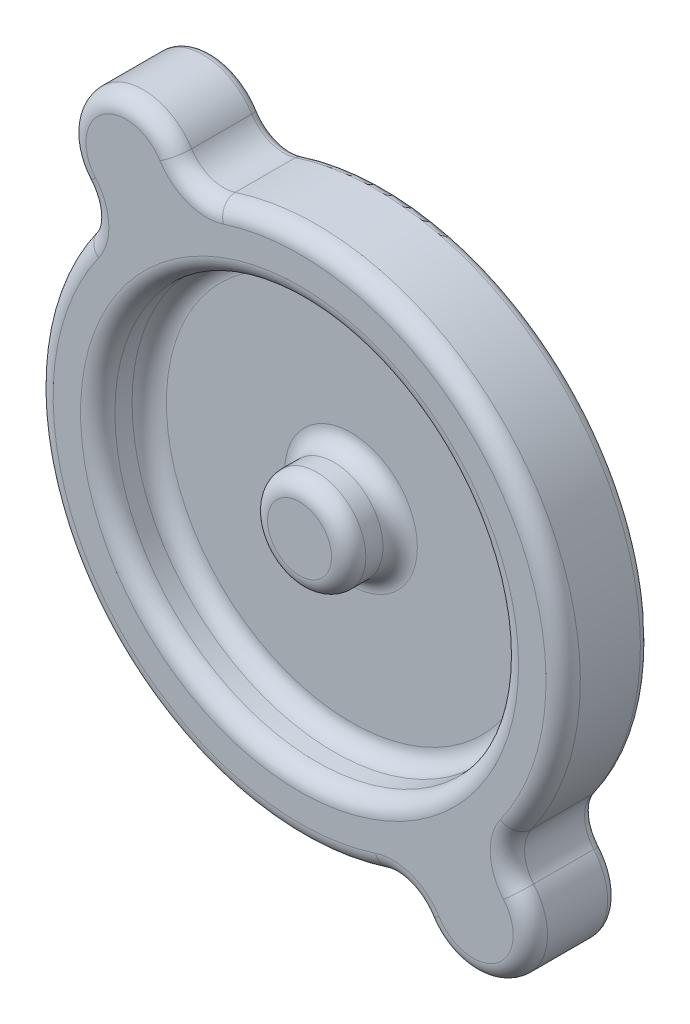
ISO-10303-21;
HEADER;
FILE_DESCRIPTION(('STEP AP214'),'2;1');
FILE_NAME('part.step','',(''),(''),'','','');
FILE_SCHEMA(('AUTOMOTIVE_DESIGN { 1 0 10303 214 1 1 1 1 }'));
ENDSEC;
DATA;
#1=APPLICATION_CONTEXT('core data for automotive mechanical design processes');
#2=APPLICATION_PROTOCOL_DEFINITION('international standard','automotive_design',2000,#1);
#3=PRODUCT_CONTEXT('',#1,'mechanical');
#4=PRODUCT('Part','Part','',(#3));
#5=PRODUCT_RELATED_PRODUCT_CATEGORY('part','',(#4));
#6=PRODUCT_DEFINITION_FORMATION('','',#4);
#7=PRODUCT_DEFINITION_CONTEXT('part definition',#1,'design');
#8=PRODUCT_DEFINITION('design','',#6,#7);
#9=PRODUCT_DEFINITION_SHAPE('','',#8);
#10=(LENGTH_UNIT() NAMED_UNIT(*) SI_UNIT(.MILLI.,.METRE.));
#11=(NAMED_UNIT(*) PLANE_ANGLE_UNIT() SI_UNIT($,.RADIAN.));
#12=(NAMED_UNIT(*) SI_UNIT($,.STERADIAN.) SOLID_ANGLE_UNIT());
#13=UNCERTAINTY_MEASURE_WITH_UNIT(LENGTH_MEASURE(1.E-05),#10,'distance_accuracy_value','');
#14=(GEOMETRIC_REPRESENTATION_CONTEXT(3) GLOBAL_UNCERTAINTY_ASSIGNED_CONTEXT((#13)) GLOBAL_UNIT_ASSIGNED_CONTEXT((#10,
#11,#12)) REPRESENTATION_CONTEXT('',''));
#15=CARTESIAN_POINT('',(0.,0.,0.));
#16=DIRECTION('',(0.,0.,1.));
#17=DIRECTION('',(1.,0.,0.));
#18=AXIS2_PLACEMENT_3D('',#15,#16,#17);
#19=CARTESIAN_POINT('',(-14.1260364773275,19.242058344294,6.985));
#20=DIRECTION('',(0.,0.,-1.));
#21=DIRECTION('',(-1.,0.,0.));
#22=AXIS2_PLACEMENT_3D('',#19,#20,#21);
#23=CYLINDRICAL_SURFACE('',#22,4.65476555000425);
#24=DIRECTION('',(0.,0.,-1.));
#25=VECTOR('',#24,1.);
#26=CARTESIAN_POINT('',(-10.1728393928643,21.6995113218499,6.985));
#27=LINE('',#26,#25);
#28=CARTESIAN_POINT('',(-10.1728393928643,21.6995113218499,5.588));
#29=VERTEX_POINT('',#28);
#30=CARTESIAN_POINT('',(-10.1728393928643,21.6995113218499,0.6985));
#31=VERTEX_POINT('',#30);
#32=EDGE_CURVE('E213',#29,#31,#27,.T.);
#33=ORIENTED_EDGE('',*,*,#32,.T.);
#34=CARTESIAN_POINT('',(-14.1260364773275,19.242058344294,0.6985));
#35=DIRECTION('',(0.,0.,1.));
#36=DIRECTION('',(1.,0.,0.));
#37=AXIS2_PLACEMENT_3D('',#34,#35,#36);
#38=CIRCLE('',#37,4.65476555000425);
#39=CARTESIAN_POINT('',(-17.654980101649,16.206700174017,0.6985));
#40=VERTEX_POINT('',#39);
#41=EDGE_CURVE('E11',#31,#40,#38,.T.);
#42=ORIENTED_EDGE('',*,*,#41,.T.);
#43=DIRECTION('',(0.,0.,-1.));
#44=VECTOR('',#43,1.);
#45=CARTESIAN_POINT('',(-17.654980101649,16.206700174017,6.985));
#46=LINE('',#45,#44);
#47=CARTESIAN_POINT('',(-17.654980101649,16.206700174017,5.588));
#48=VERTEX_POINT('',#47);
#49=EDGE_CURVE('E289',#48,#40,#46,.T.);
#50=ORIENTED_EDGE('',*,*,#49,.F.);
#51=CARTESIAN_POINT('',(-14.1260364773275,19.242058344294,5.588));
#52=DIRECTION('',(0.,0.,1.));
#53=DIRECTION('',(1.,0.,0.));
#54=AXIS2_PLACEMENT_3D('',#51,#52,#53);
#55=CIRCLE('',#54,4.65476555000425);
#56=EDGE_CURVE('E193',#48,#29,#55,.F.);
#57=ORIENTED_EDGE('',*,*,#56,.T.);
#58=EDGE_LOOP('',(#33,#42,#50,#57));
#59=FACE_BOUND('',#58,.T.);
#60=ADVANCED_FACE('F32',(#59),#23,.T.);
#61=CARTESIAN_POINT('',(-19.9792717549964,14.2075019971261,6.985));
#62=DIRECTION('',(0.,0.,-1.));
#63=DIRECTION('',(-1.,0.,0.));
#64=AXIS2_PLACEMENT_3D('',#61,#62,#63);
#65=CYLINDRICAL_SURFACE('',#64,3.06579924983751);
#66=ORIENTED_EDGE('',*,*,#49,.T.);
#67=CARTESIAN_POINT('',(-19.9792717549964,14.2075019971261,0.6985));
#68=DIRECTION('',(0.,0.,1.));
#69=DIRECTION('',(1.,0.,0.));
#70=AXIS2_PLACEMENT_3D('',#67,#68,#69);
#71=CIRCLE('',#70,3.06579924983751);
#72=CARTESIAN_POINT('',(-17.4807835052538,12.4307967581508,0.6985));
#73=VERTEX_POINT('',#72);
#74=EDGE_CURVE('E194',#40,#73,#71,.F.);
#75=ORIENTED_EDGE('',*,*,#74,.T.);
#76=DIRECTION('',(0.,0.,-1.));
#77=VECTOR('',#76,1.);
#78=CARTESIAN_POINT('',(-17.4807835052538,12.4307967581508,6.985));
#79=LINE('',#78,#77);
#80=CARTESIAN_POINT('',(-17.4807835052538,12.4307967581508,5.588));
#81=VERTEX_POINT('',#80);
#82=EDGE_CURVE('E296',#81,#73,#79,.T.);
#83=ORIENTED_EDGE('',*,*,#82,.F.);
#84=CARTESIAN_POINT('',(-19.9792717549964,14.2075019971261,5.588));
#85=DIRECTION('',(0.,0.,1.));
#86=DIRECTION('',(1.,0.,0.));
#87=AXIS2_PLACEMENT_3D('',#84,#85,#86);
#88=CIRCLE('',#87,3.06579924983751);
#89=EDGE_CURVE('E191',#81,#48,#88,.T.);
#90=ORIENTED_EDGE('',*,*,#89,.T.);
#91=EDGE_LOOP('',(#66,#75,#83,#90));
#92=FACE_BOUND('',#91,.T.);
#93=ADVANCED_FACE('F291',(#92),#65,.F.);
#94=CARTESIAN_POINT('',(0.,1.06858966120171E-13,6.985));
#95=DIRECTION('',(0.,0.,-1.));
#96=DIRECTION('',(-1.,0.,0.));
#97=AXIS2_PLACEMENT_3D('',#94,#95,#96);
#98=CYLINDRICAL_SURFACE('',#97,21.45);
#99=ORIENTED_EDGE('',*,*,#82,.T.);
#100=CARTESIAN_POINT('',(0.,1.06858966120171E-13,0.6985));
#101=DIRECTION('',(0.,0.,1.));
#102=DIRECTION('',(1.,0.,0.));
#103=AXIS2_PLACEMENT_3D('',#100,#101,#102);
#104=CIRCLE('',#103,21.45);
#105=CARTESIAN_POINT('',(6.62257011531393,-20.4020603142856,0.6985));
#106=VERTEX_POINT('',#105);
#107=EDGE_CURVE('E233',#73,#106,#104,.T.);
#108=ORIENTED_EDGE('',*,*,#107,.T.);
#109=DIRECTION('',(0.,0.,-1.));
#110=VECTOR('',#109,1.);
#111=CARTESIAN_POINT('',(6.62257011531393,-20.4020603142856,6.985));
#112=LINE('',#111,#110);
#113=CARTESIAN_POINT('',(6.62257011531393,-20.4020603142856,5.588));
#114=VERTEX_POINT('',#113);
#115=EDGE_CURVE('E301',#114,#106,#112,.T.);
#116=ORIENTED_EDGE('',*,*,#115,.F.);
#117=CARTESIAN_POINT('',(0.,1.06858966120171E-13,5.588));
#118=DIRECTION('',(0.,0.,1.));
#119=DIRECTION('',(1.,0.,0.));
#120=AXIS2_PLACEMENT_3D('',#117,#118,#119);
#121=CIRCLE('',#120,21.45);
#122=EDGE_CURVE('E189',#114,#81,#121,.F.);
#123=ORIENTED_EDGE('',*,*,#122,.T.);
#124=EDGE_LOOP('',(#99,#108,#116,#123));
#125=FACE_BOUND('',#124,.T.);
#126=ADVANCED_FACE('F387',(#125),#98,.T.);
#127=CARTESIAN_POINT('',(7.56911885617757,-23.3180799509604,6.985));
#128=DIRECTION('',(0.,0.,-1.));
#129=DIRECTION('',(-1.,0.,0.));
#130=AXIS2_PLACEMENT_3D('',#127,#128,#129);
#131=CYLINDRICAL_SURFACE('',#130,3.06579924983735);
#132=ORIENTED_EDGE('',*,*,#115,.T.);
#133=CARTESIAN_POINT('',(7.56911885617757,-23.3180799509604,0.6985));
#134=DIRECTION('',(0.,0.,1.));
#135=DIRECTION('',(1.,0.,0.));
#136=AXIS2_PLACEMENT_3D('',#133,#134,#135);
#137=CIRCLE('',#136,3.06579924983735);
#138=CARTESIAN_POINT('',(10.172839392864,-21.6995113218498,0.6985));
#139=VERTEX_POINT('',#138);
#140=EDGE_CURVE('E235',#106,#139,#137,.F.);
#141=ORIENTED_EDGE('',*,*,#140,.T.);
#142=DIRECTION('',(0.,0.,-1.));
#143=VECTOR('',#142,1.);
#144=CARTESIAN_POINT('',(10.172839392864,-21.6995113218498,6.985));
#145=LINE('',#144,#143);
#146=CARTESIAN_POINT('',(10.172839392864,-21.6995113218498,5.588));
#147=VERTEX_POINT('',#146);
#148=EDGE_CURVE('E352',#147,#139,#145,.T.);
#149=ORIENTED_EDGE('',*,*,#148,.F.);
#150=CARTESIAN_POINT('',(7.56911885617757,-23.3180799509604,5.588));
#151=DIRECTION('',(0.,0.,1.));
#152=DIRECTION('',(1.,0.,0.));
#153=AXIS2_PLACEMENT_3D('',#150,#151,#152);
#154=CIRCLE('',#153,3.06579924983735);
#155=EDGE_CURVE('E187',#147,#114,#154,.T.);
#156=ORIENTED_EDGE('',*,*,#155,.T.);
#157=EDGE_LOOP('',(#132,#141,#149,#156));
#158=FACE_BOUND('',#157,.T.);
#159=ADVANCED_FACE('F358',(#158),#131,.F.);
#160=CARTESIAN_POINT('',(14.1260364773273,-19.2420583442939,6.985));
#161=DIRECTION('',(0.,0.,-1.));
#162=DIRECTION('',(-1.,0.,0.));
#163=AXIS2_PLACEMENT_3D('',#160,#161,#162);
#164=CYLINDRICAL_SURFACE('',#163,4.65476555000441);
#165=ORIENTED_EDGE('',*,*,#148,.T.);
#166=CARTESIAN_POINT('',(14.1260364773273,-19.2420583442939,0.6985));
#167=DIRECTION('',(0.,0.,1.));
#168=DIRECTION('',(1.,0.,0.));
#169=AXIS2_PLACEMENT_3D('',#166,#167,#168);
#170=CIRCLE('',#169,4.65476555000441);
#171=CARTESIAN_POINT('',(17.6549801016489,-16.2067001740168,0.6985));
#172=VERTEX_POINT('',#171);
#173=EDGE_CURVE('E237',#139,#172,#170,.T.);
#174=ORIENTED_EDGE('',*,*,#173,.T.);
#175=DIRECTION('',(0.,0.,-1.));
#176=VECTOR('',#175,1.);
#177=CARTESIAN_POINT('',(17.6549801016489,-16.2067001740168,6.985));
#178=LINE('',#177,#176);
#179=CARTESIAN_POINT('',(17.6549801016489,-16.2067001740168,5.588));
#180=VERTEX_POINT('',#179);
#181=EDGE_CURVE('E346',#180,#172,#178,.T.);
#182=ORIENTED_EDGE('',*,*,#181,.F.);
#183=CARTESIAN_POINT('',(14.1260364773273,-19.2420583442939,5.588));
#184=DIRECTION('',(0.,0.,1.));
#185=DIRECTION('',(1.,0.,0.));
#186=AXIS2_PLACEMENT_3D('',#183,#184,#185);
#187=CIRCLE('',#186,4.65476555000441);
#188=EDGE_CURVE('E185',#180,#147,#187,.F.);
#189=ORIENTED_EDGE('',*,*,#188,.T.);
#190=EDGE_LOOP('',(#165,#174,#182,#189));
#191=FACE_BOUND('',#190,.T.);
#192=ADVANCED_FACE('F441',(#191),#164,.T.);
#193=CARTESIAN_POINT('',(19.9792717549961,-14.207501997126,6.985));
#194=DIRECTION('',(0.,0.,-1.));
#195=DIRECTION('',(-1.,0.,0.));
#196=AXIS2_PLACEMENT_3D('',#193,#194,#195);
#197=CYLINDRICAL_SURFACE('',#196,3.06579924983732);
#198=ORIENTED_EDGE('',*,*,#181,.T.);
#199=CARTESIAN_POINT('',(19.9792717549961,-14.207501997126,0.6985));
#200=DIRECTION('',(0.,0.,1.));
#201=DIRECTION('',(1.,0.,0.));
#202=AXIS2_PLACEMENT_3D('',#199,#200,#201);
#203=CIRCLE('',#202,3.06579924983732);
#204=CARTESIAN_POINT('',(17.4807835052536,-12.4307967581508,0.6985));
#205=VERTEX_POINT('',#204);
#206=EDGE_CURVE('E239',#172,#205,#203,.F.);
#207=ORIENTED_EDGE('',*,*,#206,.T.);
#208=DIRECTION('',(0.,0.,-1.));
#209=VECTOR('',#208,1.);
#210=CARTESIAN_POINT('',(17.4807835052536,-12.4307967581508,6.985));
#211=LINE('',#210,#209);
#212=CARTESIAN_POINT('',(17.4807835052536,-12.4307967581508,5.588));
#213=VERTEX_POINT('',#212);
#214=EDGE_CURVE('E344',#213,#205,#211,.T.);
#215=ORIENTED_EDGE('',*,*,#214,.F.);
#216=CARTESIAN_POINT('',(19.9792717549961,-14.207501997126,5.588));
#217=DIRECTION('',(0.,0.,1.));
#218=DIRECTION('',(1.,0.,0.));
#219=AXIS2_PLACEMENT_3D('',#216,#217,#218);
#220=CIRCLE('',#219,3.06579924983732);
#221=EDGE_CURVE('E183',#213,#180,#220,.T.);
#222=ORIENTED_EDGE('',*,*,#221,.T.);
#223=EDGE_LOOP('',(#198,#207,#215,#222));
#224=FACE_BOUND('',#223,.T.);
#225=ADVANCED_FACE('F446',(#224),#197,.F.);
#226=CARTESIAN_POINT('',(0.,1.06858966120171E-13,6.985));
#227=DIRECTION('',(0.,0.,-1.));
#228=DIRECTION('',(-1.,0.,0.));
#229=AXIS2_PLACEMENT_3D('',#226,#227,#228);
#230=CYLINDRICAL_SURFACE('',#229,21.45);
#231=ORIENTED_EDGE('',*,*,#214,.T.);
#232=CARTESIAN_POINT('',(0.,1.06858966120171E-13,0.6985));
#233=DIRECTION('',(0.,0.,1.));
#234=DIRECTION('',(1.,0.,0.));
#235=AXIS2_PLACEMENT_3D('',#232,#233,#234);
#236=CIRCLE('',#235,21.45);
#237=CARTESIAN_POINT('',(-6.62257011531417,20.4020603142857,0.6985));
#238=VERTEX_POINT('',#237);
#239=EDGE_CURVE('E56',#205,#238,#236,.T.);
#240=ORIENTED_EDGE('',*,*,#239,.T.);
#241=DIRECTION('',(0.,0.,-1.));
#242=VECTOR('',#241,1.);
#243=CARTESIAN_POINT('',(-6.62257011531417,20.4020603142857,6.985));
#244=LINE('',#243,#242);
#245=CARTESIAN_POINT('',(-6.62257011531417,20.4020603142857,5.588));
#246=VERTEX_POINT('',#245);
#247=EDGE_CURVE('E342',#246,#238,#244,.T.);
#248=ORIENTED_EDGE('',*,*,#247,.F.);
#249=CARTESIAN_POINT('',(0.,1.06858966120171E-13,5.588));
#250=DIRECTION('',(0.,0.,1.));
#251=DIRECTION('',(1.,0.,0.));
#252=AXIS2_PLACEMENT_3D('',#249,#250,#251);
#253=CIRCLE('',#252,21.45);
#254=EDGE_CURVE('E176',#246,#213,#253,.F.);
#255=ORIENTED_EDGE('',*,*,#254,.T.);
#256=EDGE_LOOP('',(#231,#240,#248,#255));
#257=FACE_BOUND('',#256,.T.);
#258=ADVANCED_FACE('F343',(#257),#230,.T.);
#259=CARTESIAN_POINT('',(-7.5691188561778,23.3180799509605,6.985));
#260=DIRECTION('',(0.,0.,-1.));
#261=DIRECTION('',(-1.,0.,0.));
#262=AXIS2_PLACEMENT_3D('',#259,#260,#261);
#263=CYLINDRICAL_SURFACE('',#262,3.06579924983745);
#264=ORIENTED_EDGE('',*,*,#247,.T.);
#265=CARTESIAN_POINT('',(-7.5691188561778,23.3180799509605,0.6985));
#266=DIRECTION('',(0.,0.,1.));
#267=DIRECTION('',(1.,0.,0.));
#268=AXIS2_PLACEMENT_3D('',#265,#266,#267);
#269=CIRCLE('',#268,3.06579924983745);
#270=EDGE_CURVE('E41',#238,#31,#269,.F.);
#271=ORIENTED_EDGE('',*,*,#270,.T.);
#272=ORIENTED_EDGE('',*,*,#32,.F.);
#273=CARTESIAN_POINT('',(-7.5691188561778,23.3180799509605,5.588));
#274=DIRECTION('',(0.,0.,1.));
#275=DIRECTION('',(1.,0.,0.));
#276=AXIS2_PLACEMENT_3D('',#273,#274,#275);
#277=CIRCLE('',#276,3.06579924983745);
#278=EDGE_CURVE('E155',#29,#246,#277,.T.);
#279=ORIENTED_EDGE('',*,*,#278,.T.);
#280=EDGE_LOOP('',(#264,#271,#272,#279));
#281=FACE_BOUND('',#280,.T.);
#282=ADVANCED_FACE('F341',(#281),#263,.F.);
#283=CARTESIAN_POINT('',(-17.0526541161619,16.7247801707101,6.985));
#284=DIRECTION('',(0.,0.,1.));
#285=DIRECTION('',(1.,0.,0.));
#286=AXIS2_PLACEMENT_3D('',#283,#284,#285);
#287=PLANE('',#286);
#288=CARTESIAN_POINT('',(0.,1.06858966120171E-13,6.985));
#289=DIRECTION('',(0.,0.,1.));
#290=DIRECTION('',(1.,0.,0.));
#291=AXIS2_PLACEMENT_3D('',#288,#289,#290);
#292=CIRCLE('',#291,20.053);
#293=CARTESIAN_POINT('',(16.3422914513217,-11.6212012769789,6.985));
#294=VERTEX_POINT('',#293);
#295=CARTESIAN_POINT('',(-6.19125401036811,19.0733107450989,6.985));
#296=VERTEX_POINT('',#295);
#297=EDGE_CURVE('E173',#294,#296,#292,.T.);
#298=ORIENTED_EDGE('',*,*,#297,.T.);
#299=CARTESIAN_POINT('',(-7.5691188561778,23.3180799509605,6.985));
#300=DIRECTION('',(0.,0.,1.));
#301=DIRECTION('',(1.,0.,0.));
#302=AXIS2_PLACEMENT_3D('',#299,#300,#301);
#303=CIRCLE('',#302,4.46279924983746);
#304=CARTESIAN_POINT('',(-11.3592828920412,20.9619743239569,6.985));
#305=VERTEX_POINT('',#304);
#306=EDGE_CURVE('E153',#296,#305,#303,.F.);
#307=ORIENTED_EDGE('',*,*,#306,.T.);
#308=CARTESIAN_POINT('',(-14.1260364773275,19.242058344294,6.985));
#309=DIRECTION('',(0.,0.,1.));
#310=DIRECTION('',(1.,0.,0.));
#311=AXIS2_PLACEMENT_3D('',#308,#309,#310);
#312=CIRCLE('',#311,3.25776555000425);
#313=CARTESIAN_POINT('',(-16.5958646230675,17.1176795387829,6.985));
#314=VERTEX_POINT('',#313);
#315=EDGE_CURVE('E161',#305,#314,#312,.T.);
#316=ORIENTED_EDGE('',*,*,#315,.T.);
#317=CARTESIAN_POINT('',(-19.9792717549964,14.2075019971261,6.985));
#318=DIRECTION('',(0.,0.,1.));
#319=DIRECTION('',(1.,0.,0.));
#320=AXIS2_PLACEMENT_3D('',#317,#318,#319);
#321=CIRCLE('',#320,4.46279924983751);
#322=CARTESIAN_POINT('',(-16.3422914513218,11.6212012769789,6.985));
#323=VERTEX_POINT('',#322);
#324=EDGE_CURVE('E167',#314,#323,#321,.F.);
#325=ORIENTED_EDGE('',*,*,#324,.T.);
#326=CARTESIAN_POINT('',(0.,1.06858966120171E-13,6.985));
#327=DIRECTION('',(0.,0.,1.));
#328=DIRECTION('',(1.,0.,0.));
#329=AXIS2_PLACEMENT_3D('',#326,#327,#328);
#330=CIRCLE('',#329,20.053);
#331=CARTESIAN_POINT('',(6.19125401036784,-19.0733107450988,6.985));
#332=VERTEX_POINT('',#331);
#333=EDGE_CURVE('E325',#323,#332,#330,.T.);
#334=ORIENTED_EDGE('',*,*,#333,.T.);
#335=CARTESIAN_POINT('',(7.56911885617757,-23.3180799509604,6.985));
#336=DIRECTION('',(0.,0.,1.));
#337=DIRECTION('',(1.,0.,0.));
#338=AXIS2_PLACEMENT_3D('',#335,#336,#337);
#339=CIRCLE('',#338,4.46279924983735);
#340=CARTESIAN_POINT('',(11.3592828920409,-20.9619743239569,6.985));
#341=VERTEX_POINT('',#340);
#342=EDGE_CURVE('E327',#332,#341,#339,.F.);
#343=ORIENTED_EDGE('',*,*,#342,.T.);
#344=CARTESIAN_POINT('',(14.1260364773273,-19.2420583442939,6.985));
#345=DIRECTION('',(0.,0.,1.));
#346=DIRECTION('',(1.,0.,0.));
#347=AXIS2_PLACEMENT_3D('',#344,#345,#346);
#348=CIRCLE('',#347,3.25776555000441);
#349=CARTESIAN_POINT('',(16.5958646230674,-17.1176795387826,6.985));
#350=VERTEX_POINT('',#349);
#351=EDGE_CURVE('E329',#341,#350,#348,.T.);
#352=ORIENTED_EDGE('',*,*,#351,.T.);
#353=CARTESIAN_POINT('',(19.9792717549961,-14.207501997126,6.985));
#354=DIRECTION('',(0.,0.,1.));
#355=DIRECTION('',(1.,0.,0.));
#356=AXIS2_PLACEMENT_3D('',#353,#354,#355);
#357=CIRCLE('',#356,4.46279924983732);
#358=EDGE_CURVE('E178',#350,#294,#357,.F.);
#359=ORIENTED_EDGE('',*,*,#358,.T.);
#360=EDGE_LOOP('',(#298,#307,#316,#325,#334,#343,#352,#359));
#361=FACE_BOUND('',#360,.T.);
#362=CARTESIAN_POINT('',(0.,0.,6.985));
#363=DIRECTION('',(0.,0.,1.));
#364=DIRECTION('',(1.,0.,0.));
#365=AXIS2_PLACEMENT_3D('',#362,#363,#364);
#366=CIRCLE('',#365,17.8217462603667);
#367=CARTESIAN_POINT('',(17.8217462603667,0.,6.985));
#368=VERTEX_POINT('',#367);
#369=EDGE_CURVE('E307',#368,#368,#366,.F.);
#370=ORIENTED_EDGE('',*,*,#369,.T.);
#371=EDGE_LOOP('',(#370));
#372=FACE_BOUND('',#371,.T.);
#373=ADVANCED_FACE('F170',(#361,#372),#287,.T.);
#374=CARTESIAN_POINT('',(-17.0526541161619,16.7247801707101,0.));
#375=DIRECTION('',(0.,0.,1.));
#376=DIRECTION('',(1.,0.,0.));
#377=AXIS2_PLACEMENT_3D('',#374,#375,#376);
#378=PLANE('',#377);
#379=CARTESIAN_POINT('',(0.,1.06858966120171E-13,0.));
#380=DIRECTION('',(0.,0.,1.));
#381=DIRECTION('',(1.,0.,0.));
#382=AXIS2_PLACEMENT_3D('',#379,#380,#381);
#383=CIRCLE('',#382,20.7515);
#384=CARTESIAN_POINT('',(6.40691206284089,-19.7376855296922,0.));
#385=VERTEX_POINT('',#384);
#386=CARTESIAN_POINT('',(-16.9115374782878,12.0259990175648,0.));
#387=VERTEX_POINT('',#386);
#388=EDGE_CURVE('E228',#385,#387,#383,.F.);
#389=ORIENTED_EDGE('',*,*,#388,.T.);
#390=CARTESIAN_POINT('',(-19.9792717549964,14.2075019971261,0.));
#391=DIRECTION('',(0.,0.,1.));
#392=DIRECTION('',(1.,0.,0.));
#393=AXIS2_PLACEMENT_3D('',#390,#391,#392);
#394=CIRCLE('',#393,3.76429924983751);
#395=CARTESIAN_POINT('',(-17.1254223623583,16.6621898564,0.));
#396=VERTEX_POINT('',#395);
#397=EDGE_CURVE('E230',#387,#396,#394,.T.);
#398=ORIENTED_EDGE('',*,*,#397,.T.);
#399=CARTESIAN_POINT('',(-14.1260364773275,19.242058344294,0.));
#400=DIRECTION('',(0.,0.,1.));
#401=DIRECTION('',(1.,0.,0.));
#402=AXIS2_PLACEMENT_3D('',#399,#400,#401);
#403=CIRCLE('',#402,3.95626555000425);
#404=CARTESIAN_POINT('',(-10.7660611424528,21.3307428229034,0.));
#405=VERTEX_POINT('',#404);
#406=EDGE_CURVE('E216',#396,#405,#403,.F.);
#407=ORIENTED_EDGE('',*,*,#406,.T.);
#408=CARTESIAN_POINT('',(-7.5691188561778,23.3180799509605,0.));
#409=DIRECTION('',(0.,0.,1.));
#410=DIRECTION('',(1.,0.,0.));
#411=AXIS2_PLACEMENT_3D('',#408,#409,#410);
#412=CIRCLE('',#411,3.76429924983746);
#413=CARTESIAN_POINT('',(-6.40691206284112,19.7376855296922,0.));
#414=VERTEX_POINT('',#413);
#415=EDGE_CURVE('E218',#405,#414,#412,.T.);
#416=ORIENTED_EDGE('',*,*,#415,.T.);
#417=CARTESIAN_POINT('',(0.,1.06858966120171E-13,0.));
#418=DIRECTION('',(0.,0.,1.));
#419=DIRECTION('',(1.,0.,0.));
#420=AXIS2_PLACEMENT_3D('',#417,#418,#419);
#421=CIRCLE('',#420,20.7515);
#422=CARTESIAN_POINT('',(16.9115374782877,-12.0259990175648,0.));
#423=VERTEX_POINT('',#422);
#424=EDGE_CURVE('E220',#414,#423,#421,.F.);
#425=ORIENTED_EDGE('',*,*,#424,.T.);
#426=CARTESIAN_POINT('',(19.9792717549961,-14.207501997126,0.));
#427=DIRECTION('',(0.,0.,1.));
#428=DIRECTION('',(1.,0.,0.));
#429=AXIS2_PLACEMENT_3D('',#426,#427,#428);
#430=CIRCLE('',#429,3.76429924983732);
#431=CARTESIAN_POINT('',(17.1254223623581,-16.6621898563997,0.));
#432=VERTEX_POINT('',#431);
#433=EDGE_CURVE('E222',#423,#432,#430,.T.);
#434=ORIENTED_EDGE('',*,*,#433,.T.);
#435=CARTESIAN_POINT('',(14.1260364773273,-19.2420583442939,0.));
#436=DIRECTION('',(0.,0.,1.));
#437=DIRECTION('',(1.,0.,0.));
#438=AXIS2_PLACEMENT_3D('',#435,#436,#437);
#439=CIRCLE('',#438,3.95626555000441);
#440=CARTESIAN_POINT('',(10.7660611424524,-21.3307428229034,0.));
#441=VERTEX_POINT('',#440);
#442=EDGE_CURVE('E224',#432,#441,#439,.F.);
#443=ORIENTED_EDGE('',*,*,#442,.T.);
#444=CARTESIAN_POINT('',(7.56911885617757,-23.3180799509604,0.));
#445=DIRECTION('',(0.,0.,1.));
#446=DIRECTION('',(1.,0.,0.));
#447=AXIS2_PLACEMENT_3D('',#444,#445,#446);
#448=CIRCLE('',#447,3.76429924983735);
#449=EDGE_CURVE('E226',#441,#385,#448,.T.);
#450=ORIENTED_EDGE('',*,*,#449,.T.);
#451=EDGE_LOOP('',(#389,#398,#407,#416,#425,#434,#443,#450));
#452=FACE_BOUND('',#451,.T.);
#453=ADVANCED_FACE('F274',(#452),#378,.F.);
#454=CARTESIAN_POINT('',(0.,0.,2.794));
#455=DIRECTION('',(0.,0.,1.));
#456=DIRECTION('',(1.,0.,0.));
#457=AXIS2_PLACEMENT_3D('',#454,#455,#456);
#458=CYLINDRICAL_SURFACE('',#457,16.4247462603667);
#459=CARTESIAN_POINT('',(0.,0.,5.588));
#460=DIRECTION('',(0.,0.,1.));
#461=DIRECTION('',(1.,0.,0.));
#462=AXIS2_PLACEMENT_3D('',#459,#460,#461);
#463=CIRCLE('',#462,16.4247462603667);
#464=CARTESIAN_POINT('',(16.4247462603667,0.,5.588));
#465=VERTEX_POINT('',#464);
#466=EDGE_CURVE('E299',#465,#465,#463,.T.);
#467=ORIENTED_EDGE('',*,*,#466,.T.);
#468=EDGE_LOOP('',(#467));
#469=FACE_BOUND('',#468,.T.);
#470=CARTESIAN_POINT('',(0.,0.,4.191));
#471=DIRECTION('',(0.,0.,1.));
#472=DIRECTION('',(1.,0.,0.));
#473=AXIS2_PLACEMENT_3D('',#470,#471,#472);
#474=CIRCLE('',#473,16.4247462603667);
#475=CARTESIAN_POINT('',(16.4247462603667,0.,4.191));
#476=VERTEX_POINT('',#475);
#477=EDGE_CURVE('E295',#476,#476,#474,.F.);
#478=ORIENTED_EDGE('',*,*,#477,.T.);
#479=EDGE_LOOP('',(#478));
#480=FACE_BOUND('',#479,.T.);
#481=ADVANCED_FACE('F457',(#469,#480),#458,.F.);
#482=CARTESIAN_POINT('',(0.,0.,2.794));
#483=DIRECTION('',(0.,0.,1.));
#484=DIRECTION('',(1.,0.,0.));
#485=AXIS2_PLACEMENT_3D('',#482,#483,#484);
#486=PLANE('',#485);
#487=CARTESIAN_POINT('',(0.,0.,2.794));
#488=DIRECTION('',(0.,0.,1.));
#489=DIRECTION('',(1.,0.,0.));
#490=AXIS2_PLACEMENT_3D('',#487,#488,#489);
#491=CIRCLE('',#490,15.0277462603667);
#492=CARTESIAN_POINT('',(15.0277462603667,0.,2.794));
#493=VERTEX_POINT('',#492);
#494=EDGE_CURVE('E313',#493,#493,#491,.T.);
#495=ORIENTED_EDGE('',*,*,#494,.T.);
#496=EDGE_LOOP('',(#495));
#497=FACE_BOUND('',#496,.T.);
#498=CARTESIAN_POINT('',(0.,0.,2.794));
#499=DIRECTION('',(0.,0.,1.));
#500=DIRECTION('',(1.,0.,0.));
#501=AXIS2_PLACEMENT_3D('',#498,#499,#500);
#502=CIRCLE('',#501,5.39435352917734);
#503=CARTESIAN_POINT('',(5.39435352917734,0.,2.794));
#504=VERTEX_POINT('',#503);
#505=EDGE_CURVE('E310',#504,#504,#502,.F.);
#506=ORIENTED_EDGE('',*,*,#505,.T.);
#507=EDGE_LOOP('',(#506));
#508=FACE_BOUND('',#507,.T.);
#509=ADVANCED_FACE('F462',(#497,#508),#486,.T.);
#510=CARTESIAN_POINT('',(0.,0.,2.794));
#511=DIRECTION('',(0.,0.,1.));
#512=DIRECTION('',(1.,0.,0.));
#513=AXIS2_PLACEMENT_3D('',#510,#511,#512);
#514=CYLINDRICAL_SURFACE('',#513,3.99735352917734);
#515=CARTESIAN_POINT('',(0.,0.,5.588));
#516=DIRECTION('',(0.,0.,1.));
#517=DIRECTION('',(1.,0.,0.));
#518=AXIS2_PLACEMENT_3D('',#515,#516,#517);
#519=CIRCLE('',#518,3.99735352917734);
#520=CARTESIAN_POINT('',(3.99735352917734,0.,5.588));
#521=VERTEX_POINT('',#520);
#522=EDGE_CURVE('E168',#521,#521,#519,.F.);
#523=ORIENTED_EDGE('',*,*,#522,.T.);
#524=EDGE_LOOP('',(#523));
#525=FACE_BOUND('',#524,.T.);
#526=CARTESIAN_POINT('',(0.,0.,4.191));
#527=DIRECTION('',(0.,0.,1.));
#528=DIRECTION('',(1.,0.,0.));
#529=AXIS2_PLACEMENT_3D('',#526,#527,#528);
#530=CIRCLE('',#529,3.99735352917734);
#531=CARTESIAN_POINT('',(3.99735352917734,0.,4.191));
#532=VERTEX_POINT('',#531);
#533=EDGE_CURVE('E319',#532,#532,#530,.T.);
#534=ORIENTED_EDGE('',*,*,#533,.T.);
#535=EDGE_LOOP('',(#534));
#536=FACE_BOUND('',#535,.T.);
#537=ADVANCED_FACE('F466',(#525,#536),#514,.T.);
#538=CARTESIAN_POINT('',(0.,0.,6.985));
#539=DIRECTION('',(0.,0.,1.));
#540=DIRECTION('',(1.,0.,0.));
#541=AXIS2_PLACEMENT_3D('',#538,#539,#540);
#542=CIRCLE('',#541,2.60035352917734);
#543=CARTESIAN_POINT('',(2.60035352917734,0.,6.985));
#544=VERTEX_POINT('',#543);
#545=EDGE_CURVE('E316',#544,#544,#542,.T.);
#546=ORIENTED_EDGE('',*,*,#545,.T.);
#547=EDGE_LOOP('',(#546));
#548=FACE_BOUND('',#547,.T.);
#549=ADVANCED_FACE('F395',(#548),#287,.T.);
#550=CARTESIAN_POINT('',(0.,0.,5.588));
#551=DIRECTION('',(0.,0.,1.));
#552=DIRECTION('',(1.,0.,0.));
#553=AXIS2_PLACEMENT_3D('',#550,#551,#552);
#554=TOROIDAL_SURFACE('',#553,17.8217462603667,1.397);
#555=ORIENTED_EDGE('',*,*,#369,.F.);
#556=EDGE_LOOP('',(#555));
#557=FACE_BOUND('',#556,.T.);
#558=ORIENTED_EDGE('',*,*,#466,.F.);
#559=EDGE_LOOP('',(#558));
#560=FACE_BOUND('',#559,.T.);
#561=ADVANCED_FACE('F391',(#557,#560),#554,.T.);
#562=CARTESIAN_POINT('',(0.,0.,4.191));
#563=DIRECTION('',(0.,0.,1.));
#564=DIRECTION('',(1.,0.,0.));
#565=AXIS2_PLACEMENT_3D('',#562,#563,#564);
#566=TOROIDAL_SURFACE('',#565,15.0277462603667,1.397);
#567=ORIENTED_EDGE('',*,*,#477,.F.);
#568=EDGE_LOOP('',(#567));
#569=FACE_BOUND('',#568,.T.);
#570=ORIENTED_EDGE('',*,*,#494,.F.);
#571=EDGE_LOOP('',(#570));
#572=FACE_BOUND('',#571,.T.);
#573=ADVANCED_FACE('F394',(#569,#572),#566,.F.);
#574=CARTESIAN_POINT('',(0.,0.,5.588));
#575=DIRECTION('',(0.,0.,1.));
#576=DIRECTION('',(1.,0.,0.));
#577=AXIS2_PLACEMENT_3D('',#574,#575,#576);
#578=TOROIDAL_SURFACE('',#577,2.60035352917734,1.397);
#579=ORIENTED_EDGE('',*,*,#522,.F.);
#580=EDGE_LOOP('',(#579));
#581=FACE_BOUND('',#580,.T.);
#582=ORIENTED_EDGE('',*,*,#545,.F.);
#583=EDGE_LOOP('',(#582));
#584=FACE_BOUND('',#583,.T.);
#585=ADVANCED_FACE('F399',(#581,#584),#578,.T.);
#586=CARTESIAN_POINT('',(0.,0.,4.191));
#587=DIRECTION('',(0.,0.,1.));
#588=DIRECTION('',(1.,0.,0.));
#589=AXIS2_PLACEMENT_3D('',#586,#587,#588);
#590=TOROIDAL_SURFACE('',#589,5.39435352917734,1.397);
#591=ORIENTED_EDGE('',*,*,#505,.F.);
#592=EDGE_LOOP('',(#591));
#593=FACE_BOUND('',#592,.T.);
#594=ORIENTED_EDGE('',*,*,#533,.F.);
#595=EDGE_LOOP('',(#594));
#596=FACE_BOUND('',#595,.T.);
#597=ADVANCED_FACE('F403',(#593,#596),#590,.F.);
#598=CARTESIAN_POINT('',(7.56911885617757,-23.3180799509604,5.588));
#599=DIRECTION('',(0.,0.,1.));
#600=DIRECTION('',(1.,0.,0.));
#601=AXIS2_PLACEMENT_3D('',#598,#599,#600);
#602=TOROIDAL_SURFACE('',#601,4.46279924983735,1.397);
#603=CARTESIAN_POINT('',(6.19125401036784,-19.0733107450988,5.588));
#604=DIRECTION('',(-0.951145002997,-0.308744527520469,0.));
#605=DIRECTION('',(0.308744527520469,-0.951145002997,0.));
#606=AXIS2_PLACEMENT_3D('',#603,#604,#605);
#607=CIRCLE('',#606,1.397);
#608=EDGE_CURVE('E207',#114,#332,#607,.T.);
#609=ORIENTED_EDGE('',*,*,#608,.F.);
#610=ORIENTED_EDGE('',*,*,#155,.F.);
#611=CARTESIAN_POINT('',(11.3592828920409,-20.9619743239569,5.588));
#612=DIRECTION('',(0.527943448742257,-0.84927952696985,0.));
#613=DIRECTION('',(0.84927952696985,0.527943448742257,0.));
#614=AXIS2_PLACEMENT_3D('',#611,#612,#613);
#615=CIRCLE('',#614,1.397);
#616=EDGE_CURVE('E210',#341,#147,#615,.T.);
#617=ORIENTED_EDGE('',*,*,#616,.F.);
#618=ORIENTED_EDGE('',*,*,#342,.F.);
#619=EDGE_LOOP('',(#609,#610,#617,#618));
#620=FACE_BOUND('',#619,.T.);
#621=ADVANCED_FACE('F407',(#620),#602,.T.);
#622=CARTESIAN_POINT('',(14.1260364773273,-19.2420583442939,5.588));
#623=DIRECTION('',(0.,0.,1.));
#624=DIRECTION('',(1.,0.,0.));
#625=AXIS2_PLACEMENT_3D('',#622,#623,#624);
#626=TOROIDAL_SURFACE('',#625,3.25776555000441,1.397);
#627=ORIENTED_EDGE('',*,*,#616,.T.);
#628=ORIENTED_EDGE('',*,*,#188,.F.);
#629=CARTESIAN_POINT('',(16.5958646230674,-17.1176795387826,5.588));
#630=DIRECTION('',(-0.652096896754375,0.758135632484923,0.));
#631=DIRECTION('',(-0.758135632484923,-0.652096896754375,0.));
#632=AXIS2_PLACEMENT_3D('',#629,#630,#631);
#633=CIRCLE('',#632,1.397);
#634=EDGE_CURVE('E204',#350,#180,#633,.T.);
#635=ORIENTED_EDGE('',*,*,#634,.F.);
#636=ORIENTED_EDGE('',*,*,#351,.F.);
#637=EDGE_LOOP('',(#627,#628,#635,#636));
#638=FACE_BOUND('',#637,.T.);
#639=ADVANCED_FACE('F424',(#638),#626,.T.);
#640=CARTESIAN_POINT('',(0.,1.06858966120171E-13,5.588));
#641=DIRECTION('',(0.,0.,1.));
#642=DIRECTION('',(1.,0.,0.));
#643=AXIS2_PLACEMENT_3D('',#640,#641,#642);
#644=TOROIDAL_SURFACE('',#643,20.053,1.397);
#645=ORIENTED_EDGE('',*,*,#608,.T.);
#646=ORIENTED_EDGE('',*,*,#333,.F.);
#647=CARTESIAN_POINT('',(-16.3422914513218,11.6212012769789,5.588));
#648=DIRECTION('',(0.579524324389308,0.814954941969871,0.));
#649=DIRECTION('',(-0.814954941969871,0.579524324389308,0.));
#650=AXIS2_PLACEMENT_3D('',#647,#648,#649);
#651=CIRCLE('',#650,1.397);
#652=EDGE_CURVE('E201',#81,#323,#651,.T.);
#653=ORIENTED_EDGE('',*,*,#652,.F.);
#654=ORIENTED_EDGE('',*,*,#122,.F.);
#655=EDGE_LOOP('',(#645,#646,#653,#654));
#656=FACE_BOUND('',#655,.T.);
#657=ADVANCED_FACE('F421',(#656),#644,.T.);
#658=CARTESIAN_POINT('',(19.9792717549961,-14.207501997126,5.588));
#659=DIRECTION('',(0.,0.,1.));
#660=DIRECTION('',(1.,0.,0.));
#661=AXIS2_PLACEMENT_3D('',#658,#659,#660);
#662=TOROIDAL_SURFACE('',#661,4.46279924983732,1.397);
#663=ORIENTED_EDGE('',*,*,#634,.T.);
#664=ORIENTED_EDGE('',*,*,#221,.F.);
#665=CARTESIAN_POINT('',(16.3422914513217,-11.6212012769789,5.588));
#666=DIRECTION('',(0.579524324389316,0.814954941969865,0.));
#667=DIRECTION('',(-0.814954941969865,0.579524324389317,0.));
#668=AXIS2_PLACEMENT_3D('',#665,#666,#667);
#669=CIRCLE('',#668,1.397);
#670=EDGE_CURVE('E198',#294,#213,#669,.T.);
#671=ORIENTED_EDGE('',*,*,#670,.F.);
#672=ORIENTED_EDGE('',*,*,#358,.F.);
#673=EDGE_LOOP('',(#663,#664,#671,#672));
#674=FACE_BOUND('',#673,.T.);
#675=ADVANCED_FACE('F336',(#674),#662,.T.);
#676=CARTESIAN_POINT('',(-19.9792717549964,14.2075019971261,5.588));
#677=DIRECTION('',(0.,0.,1.));
#678=DIRECTION('',(1.,0.,0.));
#679=AXIS2_PLACEMENT_3D('',#676,#677,#678);
#680=TOROIDAL_SURFACE('',#679,4.46279924983751,1.397);
#681=ORIENTED_EDGE('',*,*,#652,.T.);
#682=ORIENTED_EDGE('',*,*,#324,.F.);
#683=CARTESIAN_POINT('',(-16.5958646230675,17.1176795387829,5.588));
#684=DIRECTION('',(-0.652096896754373,0.758135632484925,0.));
#685=DIRECTION('',(-0.758135632484925,-0.652096896754373,0.));
#686=AXIS2_PLACEMENT_3D('',#683,#684,#685);
#687=CIRCLE('',#686,1.397);
#688=EDGE_CURVE('E164',#48,#314,#687,.T.);
#689=ORIENTED_EDGE('',*,*,#688,.F.);
#690=ORIENTED_EDGE('',*,*,#89,.F.);
#691=EDGE_LOOP('',(#681,#682,#689,#690));
#692=FACE_BOUND('',#691,.T.);
#693=ADVANCED_FACE('F415',(#692),#680,.T.);
#694=CARTESIAN_POINT('',(0.,1.06858966120171E-13,5.588));
#695=DIRECTION('',(0.,0.,1.));
#696=DIRECTION('',(1.,0.,0.));
#697=AXIS2_PLACEMENT_3D('',#694,#695,#696);
#698=TOROIDAL_SURFACE('',#697,20.053,1.397);
#699=ORIENTED_EDGE('',*,*,#670,.T.);
#700=ORIENTED_EDGE('',*,*,#254,.F.);
#701=CARTESIAN_POINT('',(-6.19125401036811,19.0733107450989,5.588));
#702=DIRECTION('',(-0.951145002997004,-0.308744527520456,0.));
#703=DIRECTION('',(0.308744527520456,-0.951145002997004,0.));
#704=AXIS2_PLACEMENT_3D('',#701,#702,#703);
#705=CIRCLE('',#704,1.397);
#706=EDGE_CURVE('E158',#296,#246,#705,.T.);
#707=ORIENTED_EDGE('',*,*,#706,.F.);
#708=ORIENTED_EDGE('',*,*,#297,.F.);
#709=EDGE_LOOP('',(#699,#700,#707,#708));
#710=FACE_BOUND('',#709,.T.);
#711=ADVANCED_FACE('F339',(#710),#698,.T.);
#712=CARTESIAN_POINT('',(-14.1260364773275,19.242058344294,5.588));
#713=DIRECTION('',(0.,0.,1.));
#714=DIRECTION('',(1.,0.,0.));
#715=AXIS2_PLACEMENT_3D('',#712,#713,#714);
#716=TOROIDAL_SURFACE('',#715,3.25776555000425,1.397);
#717=ORIENTED_EDGE('',*,*,#688,.T.);
#718=ORIENTED_EDGE('',*,*,#315,.F.);
#719=CARTESIAN_POINT('',(-11.3592828920412,20.9619743239569,5.588));
#720=DIRECTION('',(0.527943448742252,-0.849279526969853,0.));
#721=DIRECTION('',(0.849279526969853,0.527943448742252,0.));
#722=AXIS2_PLACEMENT_3D('',#719,#720,#721);
#723=CIRCLE('',#722,1.397);
#724=EDGE_CURVE('E149',#29,#305,#723,.T.);
#725=ORIENTED_EDGE('',*,*,#724,.F.);
#726=ORIENTED_EDGE('',*,*,#56,.F.);
#727=EDGE_LOOP('',(#717,#718,#725,#726));
#728=FACE_BOUND('',#727,.T.);
#729=ADVANCED_FACE('F162',(#728),#716,.T.);
#730=CARTESIAN_POINT('',(-7.5691188561778,23.3180799509605,5.588));
#731=DIRECTION('',(0.,0.,1.));
#732=DIRECTION('',(1.,0.,0.));
#733=AXIS2_PLACEMENT_3D('',#730,#731,#732);
#734=TOROIDAL_SURFACE('',#733,4.46279924983746,1.397);
#735=ORIENTED_EDGE('',*,*,#706,.T.);
#736=ORIENTED_EDGE('',*,*,#278,.F.);
#737=ORIENTED_EDGE('',*,*,#724,.T.);
#738=ORIENTED_EDGE('',*,*,#306,.F.);
#739=EDGE_LOOP('',(#735,#736,#737,#738));
#740=FACE_BOUND('',#739,.T.);
#741=ADVANCED_FACE('F151',(#740),#734,.T.);
#742=CARTESIAN_POINT('',(19.9792717549961,-14.207501997126,0.6985));
#743=DIRECTION('',(0.,0.,1.));
#744=DIRECTION('',(1.,0.,0.));
#745=AXIS2_PLACEMENT_3D('',#742,#743,#744);
#746=TOROIDAL_SURFACE('',#745,3.76429924983732,0.6985);
#747=CARTESIAN_POINT('',(17.1254223623581,-16.6621898563997,0.6985));
#748=DIRECTION('',(0.652096896754382,-0.758135632484916,0.));
#749=DIRECTION('',(0.758135632484916,0.652096896754382,0.));
#750=AXIS2_PLACEMENT_3D('',#747,#748,#749);
#751=CIRCLE('',#750,0.6985);
#752=EDGE_CURVE('E258',#432,#172,#751,.T.);
#753=ORIENTED_EDGE('',*,*,#752,.F.);
#754=ORIENTED_EDGE('',*,*,#433,.F.);
#755=CARTESIAN_POINT('',(16.9115374782877,-12.0259990175648,0.6985));
#756=DIRECTION('',(0.579524324389298,0.814954941969878,0.));
#757=DIRECTION('',(-0.814954941969878,0.579524324389298,0.));
#758=AXIS2_PLACEMENT_3D('',#755,#756,#757);
#759=CIRCLE('',#758,0.6985);
#760=EDGE_CURVE('E36',#205,#423,#759,.T.);
#761=ORIENTED_EDGE('',*,*,#760,.F.);
#762=ORIENTED_EDGE('',*,*,#206,.F.);
#763=EDGE_LOOP('',(#753,#754,#761,#762));
#764=FACE_BOUND('',#763,.T.);
#765=ADVANCED_FACE('F34',(#764),#746,.T.);
#766=CARTESIAN_POINT('',(0.,1.06858966120171E-13,0.6985));
#767=DIRECTION('',(0.,0.,1.));
#768=DIRECTION('',(1.,0.,0.));
#769=AXIS2_PLACEMENT_3D('',#766,#767,#768);
#770=TOROIDAL_SURFACE('',#769,20.7515,0.6985);
#771=ORIENTED_EDGE('',*,*,#760,.T.);
#772=ORIENTED_EDGE('',*,*,#424,.F.);
#773=CARTESIAN_POINT('',(-6.40691206284114,19.7376855296923,0.6985));
#774=DIRECTION('',(-0.951145002996998,-0.308744527520475,0.));
#775=DIRECTION('',(0.308744527520475,-0.951145002996998,0.));
#776=AXIS2_PLACEMENT_3D('',#773,#774,#775);
#777=CIRCLE('',#776,0.6985);
#778=EDGE_CURVE('E256',#238,#414,#777,.T.);
#779=ORIENTED_EDGE('',*,*,#778,.F.);
#780=ORIENTED_EDGE('',*,*,#239,.F.);
#781=EDGE_LOOP('',(#771,#772,#779,#780));
#782=FACE_BOUND('',#781,.T.);
#783=ADVANCED_FACE('F268',(#782),#770,.T.);
#784=CARTESIAN_POINT('',(14.1260364773273,-19.2420583442939,0.6985));
#785=DIRECTION('',(0.,0.,1.));
#786=DIRECTION('',(1.,0.,0.));
#787=AXIS2_PLACEMENT_3D('',#784,#785,#786);
#788=TOROIDAL_SURFACE('',#787,3.95626555000441,0.6985);
#789=ORIENTED_EDGE('',*,*,#752,.T.);
#790=ORIENTED_EDGE('',*,*,#173,.F.);
#791=CARTESIAN_POINT('',(10.7660611424524,-21.3307428229034,0.6985));
#792=DIRECTION('',(-0.52794344874225,0.849279526969854,0.));
#793=DIRECTION('',(-0.849279526969854,-0.52794344874225,0.));
#794=AXIS2_PLACEMENT_3D('',#791,#792,#793);
#795=CIRCLE('',#794,0.6985);
#796=EDGE_CURVE('E253',#441,#139,#795,.T.);
#797=ORIENTED_EDGE('',*,*,#796,.F.);
#798=ORIENTED_EDGE('',*,*,#442,.F.);
#799=EDGE_LOOP('',(#789,#790,#797,#798));
#800=FACE_BOUND('',#799,.T.);
#801=ADVANCED_FACE('F560',(#800),#788,.T.);
#802=CARTESIAN_POINT('',(-7.5691188561778,23.3180799509605,0.6985));
#803=DIRECTION('',(0.,0.,1.));
#804=DIRECTION('',(1.,0.,0.));
#805=AXIS2_PLACEMENT_3D('',#802,#803,#804);
#806=TOROIDAL_SURFACE('',#805,3.76429924983746,0.6985);
#807=ORIENTED_EDGE('',*,*,#778,.T.);
#808=ORIENTED_EDGE('',*,*,#415,.F.);
#809=CARTESIAN_POINT('',(-10.7660611424527,21.3307428229034,0.6985));
#810=DIRECTION('',(-0.527943448742257,0.84927952696985,0.));
#811=DIRECTION('',(-0.84927952696985,-0.527943448742257,0.));
#812=AXIS2_PLACEMENT_3D('',#809,#810,#811);
#813=CIRCLE('',#812,0.6985);
#814=EDGE_CURVE('E250',#31,#405,#813,.T.);
#815=ORIENTED_EDGE('',*,*,#814,.F.);
#816=ORIENTED_EDGE('',*,*,#270,.F.);
#817=EDGE_LOOP('',(#807,#808,#815,#816));
#818=FACE_BOUND('',#817,.T.);
#819=ADVANCED_FACE('F280',(#818),#806,.T.);
#820=CARTESIAN_POINT('',(7.56911885617757,-23.3180799509604,0.6985));
#821=DIRECTION('',(0.,0.,1.));
#822=DIRECTION('',(1.,0.,0.));
#823=AXIS2_PLACEMENT_3D('',#820,#821,#822);
#824=TOROIDAL_SURFACE('',#823,3.76429924983735,0.6985);
#825=ORIENTED_EDGE('',*,*,#796,.T.);
#826=ORIENTED_EDGE('',*,*,#140,.F.);
#827=CARTESIAN_POINT('',(6.40691206284089,-19.7376855296922,0.6985));
#828=DIRECTION('',(-0.951145002997002,-0.308744527520461,0.));
#829=DIRECTION('',(0.308744527520461,-0.951145002997002,0.));
#830=AXIS2_PLACEMENT_3D('',#827,#828,#829);
#831=CIRCLE('',#830,0.6985);
#832=EDGE_CURVE('E247',#385,#106,#831,.T.);
#833=ORIENTED_EDGE('',*,*,#832,.F.);
#834=ORIENTED_EDGE('',*,*,#449,.F.);
#835=EDGE_LOOP('',(#825,#826,#833,#834));
#836=FACE_BOUND('',#835,.T.);
#837=ADVANCED_FACE('F365',(#836),#824,.T.);
#838=CARTESIAN_POINT('',(-14.1260364773275,19.242058344294,0.6985));
#839=DIRECTION('',(0.,0.,1.));
#840=DIRECTION('',(1.,0.,0.));
#841=AXIS2_PLACEMENT_3D('',#838,#839,#840);
#842=TOROIDAL_SURFACE('',#841,3.95626555000425,0.6985);
#843=ORIENTED_EDGE('',*,*,#814,.T.);
#844=ORIENTED_EDGE('',*,*,#406,.F.);
#845=CARTESIAN_POINT('',(-17.1254223623583,16.6621898564,0.6985));
#846=DIRECTION('',(0.652096896754382,-0.758135632484916,0.));
#847=DIRECTION('',(0.758135632484916,0.652096896754382,0.));
#848=AXIS2_PLACEMENT_3D('',#845,#846,#847);
#849=CIRCLE('',#848,0.6985);
#850=EDGE_CURVE('E245',#40,#396,#849,.T.);
#851=ORIENTED_EDGE('',*,*,#850,.F.);
#852=ORIENTED_EDGE('',*,*,#41,.F.);
#853=EDGE_LOOP('',(#843,#844,#851,#852));
#854=FACE_BOUND('',#853,.T.);
#855=ADVANCED_FACE('F283',(#854),#842,.T.);
#856=CARTESIAN_POINT('',(0.,1.06858966120171E-13,0.6985));
#857=DIRECTION('',(0.,0.,1.));
#858=DIRECTION('',(1.,0.,0.));
#859=AXIS2_PLACEMENT_3D('',#856,#857,#858);
#860=TOROIDAL_SURFACE('',#859,20.7515,0.6985);
#861=ORIENTED_EDGE('',*,*,#832,.T.);
#862=ORIENTED_EDGE('',*,*,#107,.F.);
#863=CARTESIAN_POINT('',(-16.9115374782878,12.0259990175648,0.6985));
#864=DIRECTION('',(0.579524324389307,0.814954941969872,0.));
#865=DIRECTION('',(-0.814954941969872,0.579524324389307,0.));
#866=AXIS2_PLACEMENT_3D('',#863,#864,#865);
#867=CIRCLE('',#866,0.6985);
#868=EDGE_CURVE('E243',#387,#73,#867,.T.);
#869=ORIENTED_EDGE('',*,*,#868,.F.);
#870=ORIENTED_EDGE('',*,*,#388,.F.);
#871=EDGE_LOOP('',(#861,#862,#869,#870));
#872=FACE_BOUND('',#871,.T.);
#873=ADVANCED_FACE('F370',(#872),#860,.T.);
#874=CARTESIAN_POINT('',(-19.9792717549964,14.2075019971261,0.6985));
#875=DIRECTION('',(0.,0.,1.));
#876=DIRECTION('',(1.,0.,0.));
#877=AXIS2_PLACEMENT_3D('',#874,#875,#876);
#878=TOROIDAL_SURFACE('',#877,3.76429924983751,0.6985);
#879=ORIENTED_EDGE('',*,*,#850,.T.);
#880=ORIENTED_EDGE('',*,*,#397,.F.);
#881=ORIENTED_EDGE('',*,*,#868,.T.);
#882=ORIENTED_EDGE('',*,*,#74,.F.);
#883=EDGE_LOOP('',(#879,#880,#881,#882));
#884=FACE_BOUND('',#883,.T.);
#885=ADVANCED_FACE('F374',(#884),#878,.T.);
#886=CLOSED_SHELL('',(#60,#93,#126,#159,#192,#225,#258,#282,#373,#453,#481,#509,#537,#549,#561,
#573,#585,#597,#621,#639,#657,#675,#693,#711,#729,#741,#765,#783,#801,#819,#837,#855,#873,#885));
#887=MANIFOLD_SOLID_BREP('B2',#886);
#888=ADVANCED_BREP_SHAPE_REPRESENTATION('',(#18,#887),#14);
#889=SHAPE_DEFINITION_REPRESENTATION(#9,#888);
ENDSEC;
END-ISO-10303-21;
